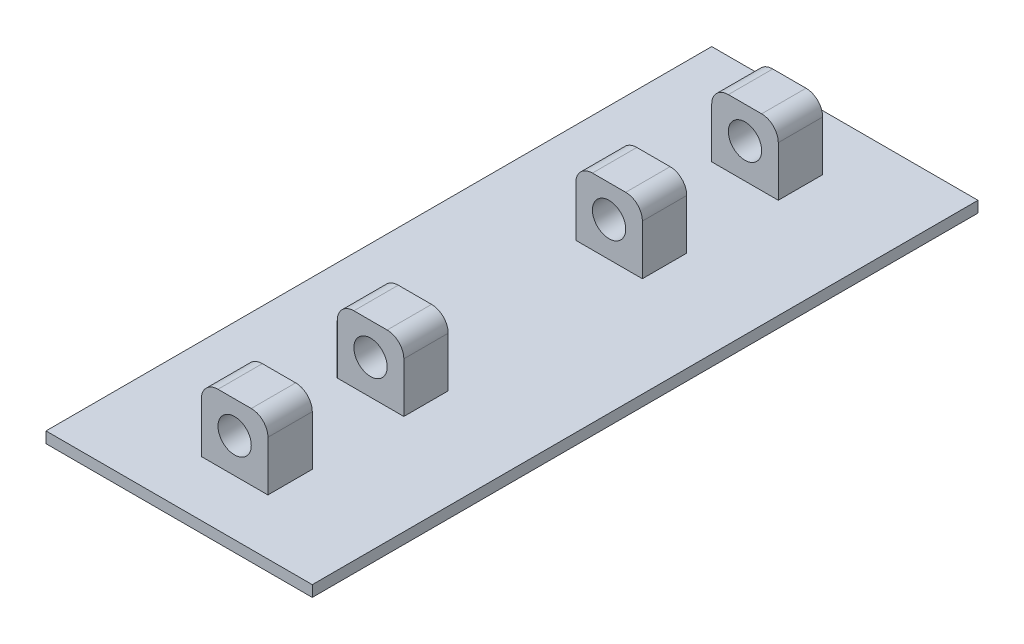
ISO-10303-21;
HEADER;
FILE_DESCRIPTION(('STEP AP214'),'2;1');
FILE_NAME('part.step','',(''),(''),'','','');
FILE_SCHEMA(('AUTOMOTIVE_DESIGN { 1 0 10303 214 1 1 1 1 }'));
ENDSEC;
DATA;
#1=APPLICATION_CONTEXT('core data for automotive mechanical design processes');
#2=APPLICATION_PROTOCOL_DEFINITION('international standard','automotive_design',2000,#1);
#3=PRODUCT_CONTEXT('',#1,'mechanical');
#4=PRODUCT('Part','Part','',(#3));
#5=PRODUCT_RELATED_PRODUCT_CATEGORY('part','',(#4));
#6=PRODUCT_DEFINITION_FORMATION('','',#4);
#7=PRODUCT_DEFINITION_CONTEXT('part definition',#1,'design');
#8=PRODUCT_DEFINITION('design','',#6,#7);
#9=PRODUCT_DEFINITION_SHAPE('','',#8);
#10=(LENGTH_UNIT() NAMED_UNIT(*) SI_UNIT(.MILLI.,.METRE.));
#11=(NAMED_UNIT(*) PLANE_ANGLE_UNIT() SI_UNIT($,.RADIAN.));
#12=(NAMED_UNIT(*) SI_UNIT($,.STERADIAN.) SOLID_ANGLE_UNIT());
#13=UNCERTAINTY_MEASURE_WITH_UNIT(LENGTH_MEASURE(1.E-05),#10,'distance_accuracy_value','');
#14=(GEOMETRIC_REPRESENTATION_CONTEXT(3) GLOBAL_UNCERTAINTY_ASSIGNED_CONTEXT((#13)) GLOBAL_UNIT_ASSIGNED_CONTEXT((#10,
#11,#12)) REPRESENTATION_CONTEXT('',''));
#15=CARTESIAN_POINT('',(0.,0.,0.));
#16=DIRECTION('',(0.,0.,1.));
#17=DIRECTION('',(1.,0.,0.));
#18=AXIS2_PLACEMENT_3D('',#15,#16,#17);
#19=CARTESIAN_POINT('',(-120.,10.,300.));
#20=DIRECTION('',(0.,1.,0.));
#21=DIRECTION('',(0.,0.,1.));
#22=AXIS2_PLACEMENT_3D('',#19,#20,#21);
#23=PLANE('',#22);
#24=DIRECTION('',(1.,0.,0.));
#25=VECTOR('',#24,1.);
#26=CARTESIAN_POINT('',(-30.,10.,-127.5));
#27=LINE('',#26,#25);
#28=CARTESIAN_POINT('',(-30.,10.,-127.5));
#29=VERTEX_POINT('',#28);
#30=CARTESIAN_POINT('',(30.,10.,-127.5));
#31=VERTEX_POINT('',#30);
#32=EDGE_CURVE('E224',#29,#31,#27,.T.);
#33=ORIENTED_EDGE('',*,*,#32,.T.);
#34=DIRECTION('',(0.,0.,1.));
#35=VECTOR('',#34,1.);
#36=CARTESIAN_POINT('',(30.,10.,-127.5));
#37=LINE('',#36,#35);
#38=CARTESIAN_POINT('',(30.,10.,-87.5));
#39=VERTEX_POINT('',#38);
#40=EDGE_CURVE('E246',#31,#39,#37,.T.);
#41=ORIENTED_EDGE('',*,*,#40,.T.);
#42=DIRECTION('',(1.,0.,0.));
#43=VECTOR('',#42,1.);
#44=CARTESIAN_POINT('',(-30.,10.,-87.5));
#45=LINE('',#44,#43);
#46=CARTESIAN_POINT('',(-30.,10.,-87.5));
#47=VERTEX_POINT('',#46);
#48=EDGE_CURVE('E245',#47,#39,#45,.T.);
#49=ORIENTED_EDGE('',*,*,#48,.F.);
#50=DIRECTION('',(0.,0.,1.));
#51=VECTOR('',#50,1.);
#52=CARTESIAN_POINT('',(-30.,10.,-127.5));
#53=LINE('',#52,#51);
#54=EDGE_CURVE('E239',#29,#47,#53,.T.);
#55=ORIENTED_EDGE('',*,*,#54,.F.);
#56=EDGE_LOOP('',(#33,#41,#49,#55));
#57=FACE_BOUND('',#56,.T.);
#58=DIRECTION('',(1.,0.,0.));
#59=VECTOR('',#58,1.);
#60=CARTESIAN_POINT('',(-30.,10.,127.5));
#61=LINE('',#60,#59);
#62=CARTESIAN_POINT('',(-30.,10.,127.5));
#63=VERTEX_POINT('',#62);
#64=CARTESIAN_POINT('',(30.,10.,127.5));
#65=VERTEX_POINT('',#64);
#66=EDGE_CURVE('E321',#63,#65,#61,.T.);
#67=ORIENTED_EDGE('',*,*,#66,.F.);
#68=DIRECTION('',(0.,0.,-1.));
#69=VECTOR('',#68,1.);
#70=CARTESIAN_POINT('',(-30.,10.,127.5));
#71=LINE('',#70,#69);
#72=CARTESIAN_POINT('',(-30.,10.,87.5));
#73=VERTEX_POINT('',#72);
#74=EDGE_CURVE('E337',#63,#73,#71,.T.);
#75=ORIENTED_EDGE('',*,*,#74,.T.);
#76=DIRECTION('',(1.,0.,0.));
#77=VECTOR('',#76,1.);
#78=CARTESIAN_POINT('',(-30.,10.,87.5));
#79=LINE('',#78,#77);
#80=CARTESIAN_POINT('',(30.,10.,87.5));
#81=VERTEX_POINT('',#80);
#82=EDGE_CURVE('E313',#73,#81,#79,.T.);
#83=ORIENTED_EDGE('',*,*,#82,.T.);
#84=DIRECTION('',(0.,0.,-1.));
#85=VECTOR('',#84,1.);
#86=CARTESIAN_POINT('',(30.,10.,127.5));
#87=LINE('',#86,#85);
#88=EDGE_CURVE('E341',#65,#81,#87,.T.);
#89=ORIENTED_EDGE('',*,*,#88,.F.);
#90=EDGE_LOOP('',(#67,#75,#83,#89));
#91=FACE_BOUND('',#90,.T.);
#92=DIRECTION('',(1.,0.,0.));
#93=VECTOR('',#92,1.);
#94=CARTESIAN_POINT('',(-30.,10.,210.));
#95=LINE('',#94,#93);
#96=CARTESIAN_POINT('',(-30.,10.,210.));
#97=VERTEX_POINT('',#96);
#98=CARTESIAN_POINT('',(30.,10.,210.));
#99=VERTEX_POINT('',#98);
#100=EDGE_CURVE('E363',#97,#99,#95,.T.);
#101=ORIENTED_EDGE('',*,*,#100,.T.);
#102=DIRECTION('',(0.,0.,1.));
#103=VECTOR('',#102,1.);
#104=CARTESIAN_POINT('',(30.,10.,210.));
#105=LINE('',#104,#103);
#106=CARTESIAN_POINT('',(30.,10.,250.));
#107=VERTEX_POINT('',#106);
#108=EDGE_CURVE('E404',#99,#107,#105,.T.);
#109=ORIENTED_EDGE('',*,*,#108,.T.);
#110=DIRECTION('',(1.,0.,0.));
#111=VECTOR('',#110,1.);
#112=CARTESIAN_POINT('',(-30.,10.,250.));
#113=LINE('',#112,#111);
#114=CARTESIAN_POINT('',(-30.,10.,250.));
#115=VERTEX_POINT('',#114);
#116=EDGE_CURVE('E381',#115,#107,#113,.T.);
#117=ORIENTED_EDGE('',*,*,#116,.F.);
#118=DIRECTION('',(0.,0.,1.));
#119=VECTOR('',#118,1.);
#120=CARTESIAN_POINT('',(-30.,10.,210.));
#121=LINE('',#120,#119);
#122=EDGE_CURVE('E379',#97,#115,#121,.T.);
#123=ORIENTED_EDGE('',*,*,#122,.F.);
#124=EDGE_LOOP('',(#101,#109,#117,#123));
#125=FACE_BOUND('',#124,.T.);
#126=DIRECTION('',(0.,0.,1.));
#127=VECTOR('',#126,1.);
#128=CARTESIAN_POINT('',(-120.,10.,-300.));
#129=LINE('',#128,#127);
#130=CARTESIAN_POINT('',(-120.,10.,-300.));
#131=VERTEX_POINT('',#130);
#132=CARTESIAN_POINT('',(-120.,10.,300.));
#133=VERTEX_POINT('',#132);
#134=EDGE_CURVE('E409',#131,#133,#129,.T.);
#135=ORIENTED_EDGE('',*,*,#134,.T.);
#136=DIRECTION('',(1.,0.,0.));
#137=VECTOR('',#136,1.);
#138=CARTESIAN_POINT('',(-120.,10.,300.));
#139=LINE('',#138,#137);
#140=CARTESIAN_POINT('',(120.,10.,300.));
#141=VERTEX_POINT('',#140);
#142=EDGE_CURVE('E412',#133,#141,#139,.T.);
#143=ORIENTED_EDGE('',*,*,#142,.T.);
#144=DIRECTION('',(0.,0.,-1.));
#145=VECTOR('',#144,1.);
#146=CARTESIAN_POINT('',(120.,10.,-300.));
#147=LINE('',#146,#145);
#148=CARTESIAN_POINT('',(120.,10.,-300.));
#149=VERTEX_POINT('',#148);
#150=EDGE_CURVE('E415',#141,#149,#147,.T.);
#151=ORIENTED_EDGE('',*,*,#150,.T.);
#152=DIRECTION('',(-1.,0.,0.));
#153=VECTOR('',#152,1.);
#154=CARTESIAN_POINT('',(-120.,10.,-300.));
#155=LINE('',#154,#153);
#156=EDGE_CURVE('E417',#149,#131,#155,.T.);
#157=ORIENTED_EDGE('',*,*,#156,.T.);
#158=EDGE_LOOP('',(#135,#143,#151,#157));
#159=FACE_BOUND('',#158,.T.);
#160=DIRECTION('',(1.,0.,0.));
#161=VECTOR('',#160,1.);
#162=CARTESIAN_POINT('',(-30.,10.,-210.));
#163=LINE('',#162,#161);
#164=CARTESIAN_POINT('',(-30.,10.,-210.));
#165=VERTEX_POINT('',#164);
#166=CARTESIAN_POINT('',(30.,10.,-210.));
#167=VERTEX_POINT('',#166);
#168=EDGE_CURVE('E272',#165,#167,#163,.T.);
#169=ORIENTED_EDGE('',*,*,#168,.F.);
#170=DIRECTION('',(0.,0.,-1.));
#171=VECTOR('',#170,1.);
#172=CARTESIAN_POINT('',(-30.,10.,-210.));
#173=LINE('',#172,#171);
#174=CARTESIAN_POINT('',(-30.,10.,-250.));
#175=VERTEX_POINT('',#174);
#176=EDGE_CURVE('E287',#165,#175,#173,.T.);
#177=ORIENTED_EDGE('',*,*,#176,.T.);
#178=DIRECTION('',(1.,0.,0.));
#179=VECTOR('',#178,1.);
#180=CARTESIAN_POINT('',(-30.,10.,-250.));
#181=LINE('',#180,#179);
#182=CARTESIAN_POINT('',(30.,10.,-250.));
#183=VERTEX_POINT('',#182);
#184=EDGE_CURVE('E265',#175,#183,#181,.T.);
#185=ORIENTED_EDGE('',*,*,#184,.T.);
#186=DIRECTION('',(0.,0.,-1.));
#187=VECTOR('',#186,1.);
#188=CARTESIAN_POINT('',(30.,10.,-210.));
#189=LINE('',#188,#187);
#190=EDGE_CURVE('E291',#167,#183,#189,.T.);
#191=ORIENTED_EDGE('',*,*,#190,.F.);
#192=EDGE_LOOP('',(#169,#177,#185,#191));
#193=FACE_BOUND('',#192,.T.);
#194=ADVANCED_FACE('F36',(#57,#91,#125,#159,#193),#23,.T.);
#195=CARTESIAN_POINT('',(-120.,10.,-300.));
#196=DIRECTION('',(1.,0.,0.));
#197=DIRECTION('',(0.,0.,-1.));
#198=AXIS2_PLACEMENT_3D('',#195,#196,#197);
#199=PLANE('',#198);
#200=DIRECTION('',(0.,0.,1.));
#201=VECTOR('',#200,1.);
#202=CARTESIAN_POINT('',(-120.,0.,-300.));
#203=LINE('',#202,#201);
#204=CARTESIAN_POINT('',(-120.,0.,-300.));
#205=VERTEX_POINT('',#204);
#206=CARTESIAN_POINT('',(-120.,0.,300.));
#207=VERTEX_POINT('',#206);
#208=EDGE_CURVE('E397',#205,#207,#203,.T.);
#209=ORIENTED_EDGE('',*,*,#208,.T.);
#210=DIRECTION('',(0.,-1.,0.));
#211=VECTOR('',#210,1.);
#212=CARTESIAN_POINT('',(-120.,10.,300.));
#213=LINE('',#212,#211);
#214=EDGE_CURVE('E11',#133,#207,#213,.T.);
#215=ORIENTED_EDGE('',*,*,#214,.F.);
#216=ORIENTED_EDGE('',*,*,#134,.F.);
#217=DIRECTION('',(0.,-1.,0.));
#218=VECTOR('',#217,1.);
#219=CARTESIAN_POINT('',(-120.,10.,-300.));
#220=LINE('',#219,#218);
#221=EDGE_CURVE('E419',#131,#205,#220,.T.);
#222=ORIENTED_EDGE('',*,*,#221,.T.);
#223=EDGE_LOOP('',(#209,#215,#216,#222));
#224=FACE_BOUND('',#223,.T.);
#225=ADVANCED_FACE('F38',(#224),#199,.F.);
#226=CARTESIAN_POINT('',(-120.,10.,300.));
#227=DIRECTION('',(0.,0.,-1.));
#228=DIRECTION('',(-1.,0.,0.));
#229=AXIS2_PLACEMENT_3D('',#226,#227,#228);
#230=PLANE('',#229);
#231=DIRECTION('',(1.,0.,0.));
#232=VECTOR('',#231,1.);
#233=CARTESIAN_POINT('',(-120.,0.,300.));
#234=LINE('',#233,#232);
#235=CARTESIAN_POINT('',(120.,0.,300.));
#236=VERTEX_POINT('',#235);
#237=EDGE_CURVE('E422',#207,#236,#234,.T.);
#238=ORIENTED_EDGE('',*,*,#237,.T.);
#239=DIRECTION('',(0.,-1.,0.));
#240=VECTOR('',#239,1.);
#241=CARTESIAN_POINT('',(120.,10.,300.));
#242=LINE('',#241,#240);
#243=EDGE_CURVE('E44',#141,#236,#242,.T.);
#244=ORIENTED_EDGE('',*,*,#243,.F.);
#245=ORIENTED_EDGE('',*,*,#142,.F.);
#246=ORIENTED_EDGE('',*,*,#214,.T.);
#247=EDGE_LOOP('',(#238,#244,#245,#246));
#248=FACE_BOUND('',#247,.T.);
#249=ADVANCED_FACE('F452',(#248),#230,.F.);
#250=CARTESIAN_POINT('',(120.,10.,-300.));
#251=DIRECTION('',(-1.,0.,0.));
#252=DIRECTION('',(0.,0.,1.));
#253=AXIS2_PLACEMENT_3D('',#250,#251,#252);
#254=PLANE('',#253);
#255=DIRECTION('',(0.,0.,-1.));
#256=VECTOR('',#255,1.);
#257=CARTESIAN_POINT('',(120.,0.,-300.));
#258=LINE('',#257,#256);
#259=CARTESIAN_POINT('',(120.,0.,-300.));
#260=VERTEX_POINT('',#259);
#261=EDGE_CURVE('E424',#236,#260,#258,.T.);
#262=ORIENTED_EDGE('',*,*,#261,.T.);
#263=DIRECTION('',(0.,-1.,0.));
#264=VECTOR('',#263,1.);
#265=CARTESIAN_POINT('',(120.,10.,-300.));
#266=LINE('',#265,#264);
#267=EDGE_CURVE('E429',#149,#260,#266,.T.);
#268=ORIENTED_EDGE('',*,*,#267,.F.);
#269=ORIENTED_EDGE('',*,*,#150,.F.);
#270=ORIENTED_EDGE('',*,*,#243,.T.);
#271=EDGE_LOOP('',(#262,#268,#269,#270));
#272=FACE_BOUND('',#271,.T.);
#273=ADVANCED_FACE('F436',(#272),#254,.F.);
#274=CARTESIAN_POINT('',(-120.,10.,-300.));
#275=DIRECTION('',(0.,0.,1.));
#276=DIRECTION('',(1.,0.,0.));
#277=AXIS2_PLACEMENT_3D('',#274,#275,#276);
#278=PLANE('',#277);
#279=DIRECTION('',(-1.,0.,0.));
#280=VECTOR('',#279,1.);
#281=CARTESIAN_POINT('',(-120.,0.,-300.));
#282=LINE('',#281,#280);
#283=EDGE_CURVE('E413',#260,#205,#282,.T.);
#284=ORIENTED_EDGE('',*,*,#283,.T.);
#285=ORIENTED_EDGE('',*,*,#221,.F.);
#286=ORIENTED_EDGE('',*,*,#156,.F.);
#287=ORIENTED_EDGE('',*,*,#267,.T.);
#288=EDGE_LOOP('',(#284,#285,#286,#287));
#289=FACE_BOUND('',#288,.T.);
#290=ADVANCED_FACE('F445',(#289),#278,.F.);
#291=CARTESIAN_POINT('',(-120.,0.,300.));
#292=DIRECTION('',(0.,1.,0.));
#293=DIRECTION('',(0.,0.,1.));
#294=AXIS2_PLACEMENT_3D('',#291,#292,#293);
#295=PLANE('',#294);
#296=ORIENTED_EDGE('',*,*,#208,.F.);
#297=ORIENTED_EDGE('',*,*,#283,.F.);
#298=ORIENTED_EDGE('',*,*,#261,.F.);
#299=ORIENTED_EDGE('',*,*,#237,.F.);
#300=EDGE_LOOP('',(#296,#297,#298,#299));
#301=FACE_BOUND('',#300,.T.);
#302=ADVANCED_FACE('F442',(#301),#295,.F.);
#303=CARTESIAN_POINT('',(-30.,10.,210.));
#304=DIRECTION('',(-1.,0.,0.));
#305=DIRECTION('',(0.,0.,1.));
#306=AXIS2_PLACEMENT_3D('',#303,#304,#305);
#307=PLANE('',#306);
#308=DIRECTION('',(0.,-1.,0.));
#309=VECTOR('',#308,1.);
#310=CARTESIAN_POINT('',(-30.,10.,250.));
#311=LINE('',#310,#309);
#312=CARTESIAN_POINT('',(-30.,55.,250.));
#313=VERTEX_POINT('',#312);
#314=EDGE_CURVE('E357',#313,#115,#311,.T.);
#315=ORIENTED_EDGE('',*,*,#314,.F.);
#316=DIRECTION('',(0.,0.,1.));
#317=VECTOR('',#316,1.);
#318=CARTESIAN_POINT('',(-30.,55.,210.));
#319=LINE('',#318,#317);
#320=CARTESIAN_POINT('',(-30.,55.,210.));
#321=VERTEX_POINT('',#320);
#322=EDGE_CURVE('E395',#321,#313,#319,.T.);
#323=ORIENTED_EDGE('',*,*,#322,.F.);
#324=DIRECTION('',(0.,-1.,0.));
#325=VECTOR('',#324,1.);
#326=CARTESIAN_POINT('',(-30.,10.,210.));
#327=LINE('',#326,#325);
#328=EDGE_CURVE('E360',#321,#97,#327,.T.);
#329=ORIENTED_EDGE('',*,*,#328,.T.);
#330=ORIENTED_EDGE('',*,*,#122,.T.);
#331=EDGE_LOOP('',(#315,#323,#329,#330));
#332=FACE_BOUND('',#331,.T.);
#333=ADVANCED_FACE('F465',(#332),#307,.T.);
#334=CARTESIAN_POINT('',(-15.,55.,210.));
#335=DIRECTION('',(0.,0.,1.));
#336=DIRECTION('',(1.,0.,0.));
#337=AXIS2_PLACEMENT_3D('',#334,#335,#336);
#338=CYLINDRICAL_SURFACE('',#337,15.);
#339=CARTESIAN_POINT('',(-15.,55.,250.));
#340=DIRECTION('',(0.,0.,1.));
#341=DIRECTION('',(-1.,0.,0.));
#342=AXIS2_PLACEMENT_3D('',#339,#340,#341);
#343=CIRCLE('',#342,15.);
#344=CARTESIAN_POINT('',(-15.,70.,250.));
#345=VERTEX_POINT('',#344);
#346=EDGE_CURVE('E364',#345,#313,#343,.T.);
#347=ORIENTED_EDGE('',*,*,#346,.F.);
#348=DIRECTION('',(0.,0.,1.));
#349=VECTOR('',#348,1.);
#350=CARTESIAN_POINT('',(-15.,70.,210.));
#351=LINE('',#350,#349);
#352=CARTESIAN_POINT('',(-15.,70.,210.));
#353=VERTEX_POINT('',#352);
#354=EDGE_CURVE('E398',#353,#345,#351,.T.);
#355=ORIENTED_EDGE('',*,*,#354,.F.);
#356=CARTESIAN_POINT('',(-15.,55.,210.));
#357=DIRECTION('',(0.,0.,1.));
#358=DIRECTION('',(-1.,0.,0.));
#359=AXIS2_PLACEMENT_3D('',#356,#357,#358);
#360=CIRCLE('',#359,15.);
#361=EDGE_CURVE('E376',#353,#321,#360,.T.);
#362=ORIENTED_EDGE('',*,*,#361,.T.);
#363=ORIENTED_EDGE('',*,*,#322,.T.);
#364=EDGE_LOOP('',(#347,#355,#362,#363));
#365=FACE_BOUND('',#364,.T.);
#366=ADVANCED_FACE('F484',(#365),#338,.T.);
#367=CARTESIAN_POINT('',(-15.,70.,210.));
#368=DIRECTION('',(0.,1.,0.));
#369=DIRECTION('',(0.,0.,1.));
#370=AXIS2_PLACEMENT_3D('',#367,#368,#369);
#371=PLANE('',#370);
#372=DIRECTION('',(-1.,0.,0.));
#373=VECTOR('',#372,1.);
#374=CARTESIAN_POINT('',(-15.,70.,250.));
#375=LINE('',#374,#373);
#376=CARTESIAN_POINT('',(15.,70.,250.));
#377=VERTEX_POINT('',#376);
#378=EDGE_CURVE('E390',#377,#345,#375,.T.);
#379=ORIENTED_EDGE('',*,*,#378,.F.);
#380=DIRECTION('',(0.,0.,1.));
#381=VECTOR('',#380,1.);
#382=CARTESIAN_POINT('',(15.,70.,210.));
#383=LINE('',#382,#381);
#384=CARTESIAN_POINT('',(15.,70.,210.));
#385=VERTEX_POINT('',#384);
#386=EDGE_CURVE('E400',#385,#377,#383,.T.);
#387=ORIENTED_EDGE('',*,*,#386,.F.);
#388=DIRECTION('',(-1.,0.,0.));
#389=VECTOR('',#388,1.);
#390=CARTESIAN_POINT('',(-15.,70.,210.));
#391=LINE('',#390,#389);
#392=EDGE_CURVE('E373',#385,#353,#391,.T.);
#393=ORIENTED_EDGE('',*,*,#392,.T.);
#394=ORIENTED_EDGE('',*,*,#354,.T.);
#395=EDGE_LOOP('',(#379,#387,#393,#394));
#396=FACE_BOUND('',#395,.T.);
#397=ADVANCED_FACE('F491',(#396),#371,.T.);
#398=CARTESIAN_POINT('',(15.,55.,210.));
#399=DIRECTION('',(0.,0.,1.));
#400=DIRECTION('',(1.,0.,0.));
#401=AXIS2_PLACEMENT_3D('',#398,#399,#400);
#402=CYLINDRICAL_SURFACE('',#401,15.);
#403=CARTESIAN_POINT('',(15.,55.,250.));
#404=DIRECTION('',(0.,0.,1.));
#405=DIRECTION('',(1.,0.,0.));
#406=AXIS2_PLACEMENT_3D('',#403,#404,#405);
#407=CIRCLE('',#406,15.);
#408=CARTESIAN_POINT('',(30.,55.,250.));
#409=VERTEX_POINT('',#408);
#410=EDGE_CURVE('E387',#409,#377,#407,.T.);
#411=ORIENTED_EDGE('',*,*,#410,.F.);
#412=DIRECTION('',(0.,0.,1.));
#413=VECTOR('',#412,1.);
#414=CARTESIAN_POINT('',(30.,55.,210.));
#415=LINE('',#414,#413);
#416=CARTESIAN_POINT('',(30.,55.,210.));
#417=VERTEX_POINT('',#416);
#418=EDGE_CURVE('E402',#417,#409,#415,.T.);
#419=ORIENTED_EDGE('',*,*,#418,.F.);
#420=CARTESIAN_POINT('',(15.,55.,210.));
#421=DIRECTION('',(0.,0.,1.));
#422=DIRECTION('',(1.,0.,0.));
#423=AXIS2_PLACEMENT_3D('',#420,#421,#422);
#424=CIRCLE('',#423,15.);
#425=EDGE_CURVE('E370',#417,#385,#424,.T.);
#426=ORIENTED_EDGE('',*,*,#425,.T.);
#427=ORIENTED_EDGE('',*,*,#386,.T.);
#428=EDGE_LOOP('',(#411,#419,#426,#427));
#429=FACE_BOUND('',#428,.T.);
#430=ADVANCED_FACE('F499',(#429),#402,.T.);
#431=CARTESIAN_POINT('',(30.,10.,210.));
#432=DIRECTION('',(1.,0.,0.));
#433=DIRECTION('',(0.,0.,-1.));
#434=AXIS2_PLACEMENT_3D('',#431,#432,#433);
#435=PLANE('',#434);
#436=DIRECTION('',(0.,1.,0.));
#437=VECTOR('',#436,1.);
#438=CARTESIAN_POINT('',(30.,10.,250.));
#439=LINE('',#438,#437);
#440=EDGE_CURVE('E384',#107,#409,#439,.T.);
#441=ORIENTED_EDGE('',*,*,#440,.F.);
#442=ORIENTED_EDGE('',*,*,#108,.F.);
#443=DIRECTION('',(0.,1.,0.));
#444=VECTOR('',#443,1.);
#445=CARTESIAN_POINT('',(30.,10.,210.));
#446=LINE('',#445,#444);
#447=EDGE_CURVE('E367',#99,#417,#446,.T.);
#448=ORIENTED_EDGE('',*,*,#447,.T.);
#449=ORIENTED_EDGE('',*,*,#418,.T.);
#450=EDGE_LOOP('',(#441,#442,#448,#449));
#451=FACE_BOUND('',#450,.T.);
#452=ADVANCED_FACE('F507',(#451),#435,.T.);
#453=CARTESIAN_POINT('',(-15.,55.,210.));
#454=DIRECTION('',(0.,0.,-1.));
#455=DIRECTION('',(-1.,0.,0.));
#456=AXIS2_PLACEMENT_3D('',#453,#454,#455);
#457=PLANE('',#456);
#458=CARTESIAN_POINT('',(0.,41.2142525033233,210.));
#459=DIRECTION('',(0.,0.,1.));
#460=DIRECTION('',(1.,0.,0.));
#461=AXIS2_PLACEMENT_3D('',#458,#459,#460);
#462=CIRCLE('',#461,15.);
#463=CARTESIAN_POINT('',(15.,41.2142525033233,210.));
#464=VERTEX_POINT('',#463);
#465=EDGE_CURVE('E354',#464,#464,#462,.T.);
#466=ORIENTED_EDGE('',*,*,#465,.T.);
#467=EDGE_LOOP('',(#466));
#468=FACE_BOUND('',#467,.T.);
#469=ORIENTED_EDGE('',*,*,#328,.F.);
#470=ORIENTED_EDGE('',*,*,#361,.F.);
#471=ORIENTED_EDGE('',*,*,#392,.F.);
#472=ORIENTED_EDGE('',*,*,#425,.F.);
#473=ORIENTED_EDGE('',*,*,#447,.F.);
#474=ORIENTED_EDGE('',*,*,#100,.F.);
#475=EDGE_LOOP('',(#469,#470,#471,#472,#473,#474));
#476=FACE_BOUND('',#475,.T.);
#477=ADVANCED_FACE('F515',(#468,#476),#457,.T.);
#478=CARTESIAN_POINT('',(-15.,55.,250.));
#479=DIRECTION('',(0.,0.,-1.));
#480=DIRECTION('',(-1.,0.,0.));
#481=AXIS2_PLACEMENT_3D('',#478,#479,#480);
#482=PLANE('',#481);
#483=CARTESIAN_POINT('',(0.,41.2142525033233,250.));
#484=DIRECTION('',(0.,0.,1.));
#485=DIRECTION('',(1.,0.,0.));
#486=AXIS2_PLACEMENT_3D('',#483,#484,#485);
#487=CIRCLE('',#486,15.);
#488=CARTESIAN_POINT('',(15.,41.2142525033233,250.));
#489=VERTEX_POINT('',#488);
#490=EDGE_CURVE('E340',#489,#489,#487,.T.);
#491=ORIENTED_EDGE('',*,*,#490,.F.);
#492=EDGE_LOOP('',(#491));
#493=FACE_BOUND('',#492,.T.);
#494=ORIENTED_EDGE('',*,*,#314,.T.);
#495=ORIENTED_EDGE('',*,*,#116,.T.);
#496=ORIENTED_EDGE('',*,*,#440,.T.);
#497=ORIENTED_EDGE('',*,*,#410,.T.);
#498=ORIENTED_EDGE('',*,*,#378,.T.);
#499=ORIENTED_EDGE('',*,*,#346,.T.);
#500=EDGE_LOOP('',(#494,#495,#496,#497,#498,#499));
#501=FACE_BOUND('',#500,.T.);
#502=ADVANCED_FACE('F522',(#493,#501),#482,.F.);
#503=CARTESIAN_POINT('',(0.,41.2142525033233,210.));
#504=DIRECTION('',(0.,0.,1.));
#505=DIRECTION('',(1.,0.,0.));
#506=AXIS2_PLACEMENT_3D('',#503,#504,#505);
#507=CYLINDRICAL_SURFACE('',#506,15.);
#508=ORIENTED_EDGE('',*,*,#465,.F.);
#509=EDGE_LOOP('',(#508));
#510=FACE_BOUND('',#509,.T.);
#511=ORIENTED_EDGE('',*,*,#490,.T.);
#512=EDGE_LOOP('',(#511));
#513=FACE_BOUND('',#512,.T.);
#514=ADVANCED_FACE('F530',(#510,#513),#507,.F.);
#515=CARTESIAN_POINT('',(-15.,55.,127.5));
#516=DIRECTION('',(0.,0.,1.));
#517=DIRECTION('',(-1.,0.,0.));
#518=AXIS2_PLACEMENT_3D('',#515,#516,#517);
#519=PLANE('',#518);
#520=DIRECTION('',(0.,-1.,0.));
#521=VECTOR('',#520,1.);
#522=CARTESIAN_POINT('',(-30.,10.,127.5));
#523=LINE('',#522,#521);
#524=CARTESIAN_POINT('',(-30.,55.,127.5));
#525=VERTEX_POINT('',#524);
#526=EDGE_CURVE('E310',#525,#63,#523,.T.);
#527=ORIENTED_EDGE('',*,*,#526,.T.);
#528=ORIENTED_EDGE('',*,*,#66,.T.);
#529=DIRECTION('',(0.,1.,0.));
#530=VECTOR('',#529,1.);
#531=CARTESIAN_POINT('',(30.,10.,127.5));
#532=LINE('',#531,#530);
#533=CARTESIAN_POINT('',(30.,55.,127.5));
#534=VERTEX_POINT('',#533);
#535=EDGE_CURVE('E319',#65,#534,#532,.T.);
#536=ORIENTED_EDGE('',*,*,#535,.T.);
#537=CARTESIAN_POINT('',(15.,55.,127.5));
#538=DIRECTION('',(0.,0.,1.));
#539=DIRECTION('',(1.,0.,0.));
#540=AXIS2_PLACEMENT_3D('',#537,#538,#539);
#541=CIRCLE('',#540,15.);
#542=CARTESIAN_POINT('',(15.,70.,127.5));
#543=VERTEX_POINT('',#542);
#544=EDGE_CURVE('E317',#534,#543,#541,.T.);
#545=ORIENTED_EDGE('',*,*,#544,.T.);
#546=DIRECTION('',(-1.,0.,0.));
#547=VECTOR('',#546,1.);
#548=CARTESIAN_POINT('',(-15.,70.,127.5));
#549=LINE('',#548,#547);
#550=CARTESIAN_POINT('',(-15.,70.,127.5));
#551=VERTEX_POINT('',#550);
#552=EDGE_CURVE('E315',#543,#551,#549,.T.);
#553=ORIENTED_EDGE('',*,*,#552,.T.);
#554=CARTESIAN_POINT('',(-15.,55.,127.5));
#555=DIRECTION('',(0.,0.,1.));
#556=DIRECTION('',(-1.,0.,0.));
#557=AXIS2_PLACEMENT_3D('',#554,#555,#556);
#558=CIRCLE('',#557,15.);
#559=EDGE_CURVE('E312',#551,#525,#558,.T.);
#560=ORIENTED_EDGE('',*,*,#559,.T.);
#561=EDGE_LOOP('',(#527,#528,#536,#545,#553,#560));
#562=FACE_BOUND('',#561,.T.);
#563=CARTESIAN_POINT('',(0.,41.2142525033233,127.5));
#564=DIRECTION('',(0.,0.,1.));
#565=DIRECTION('',(1.,0.,0.));
#566=AXIS2_PLACEMENT_3D('',#563,#564,#565);
#567=CIRCLE('',#566,15.);
#568=CARTESIAN_POINT('',(15.,41.2142525033233,127.5));
#569=VERTEX_POINT('',#568);
#570=EDGE_CURVE('E304',#569,#569,#567,.T.);
#571=ORIENTED_EDGE('',*,*,#570,.F.);
#572=EDGE_LOOP('',(#571));
#573=FACE_BOUND('',#572,.T.);
#574=ADVANCED_FACE('F538',(#562,#573),#519,.T.);
#575=CARTESIAN_POINT('',(-15.,55.,87.5));
#576=DIRECTION('',(0.,0.,1.));
#577=DIRECTION('',(-1.,0.,0.));
#578=AXIS2_PLACEMENT_3D('',#575,#576,#577);
#579=PLANE('',#578);
#580=DIRECTION('',(0.,-1.,0.));
#581=VECTOR('',#580,1.);
#582=CARTESIAN_POINT('',(-30.,10.,87.5));
#583=LINE('',#582,#581);
#584=CARTESIAN_POINT('',(-30.,55.,87.5));
#585=VERTEX_POINT('',#584);
#586=EDGE_CURVE('E307',#585,#73,#583,.T.);
#587=ORIENTED_EDGE('',*,*,#586,.F.);
#588=CARTESIAN_POINT('',(-15.,55.,87.5));
#589=DIRECTION('',(0.,0.,1.));
#590=DIRECTION('',(-1.,0.,0.));
#591=AXIS2_PLACEMENT_3D('',#588,#589,#590);
#592=CIRCLE('',#591,15.);
#593=CARTESIAN_POINT('',(-15.,70.,87.5));
#594=VERTEX_POINT('',#593);
#595=EDGE_CURVE('E327',#594,#585,#592,.T.);
#596=ORIENTED_EDGE('',*,*,#595,.F.);
#597=DIRECTION('',(-1.,0.,0.));
#598=VECTOR('',#597,1.);
#599=CARTESIAN_POINT('',(-15.,70.,87.5));
#600=LINE('',#599,#598);
#601=CARTESIAN_POINT('',(15.,70.,87.5));
#602=VERTEX_POINT('',#601);
#603=EDGE_CURVE('E329',#602,#594,#600,.T.);
#604=ORIENTED_EDGE('',*,*,#603,.F.);
#605=CARTESIAN_POINT('',(15.,55.,87.5));
#606=DIRECTION('',(0.,0.,1.));
#607=DIRECTION('',(1.,0.,0.));
#608=AXIS2_PLACEMENT_3D('',#605,#606,#607);
#609=CIRCLE('',#608,15.);
#610=CARTESIAN_POINT('',(30.,55.,87.5));
#611=VERTEX_POINT('',#610);
#612=EDGE_CURVE('E331',#611,#602,#609,.T.);
#613=ORIENTED_EDGE('',*,*,#612,.F.);
#614=DIRECTION('',(0.,1.,0.));
#615=VECTOR('',#614,1.);
#616=CARTESIAN_POINT('',(30.,10.,87.5));
#617=LINE('',#616,#615);
#618=EDGE_CURVE('E333',#81,#611,#617,.T.);
#619=ORIENTED_EDGE('',*,*,#618,.F.);
#620=ORIENTED_EDGE('',*,*,#82,.F.);
#621=EDGE_LOOP('',(#587,#596,#604,#613,#619,#620));
#622=FACE_BOUND('',#621,.T.);
#623=CARTESIAN_POINT('',(0.,41.2142525033233,87.5));
#624=DIRECTION('',(0.,0.,1.));
#625=DIRECTION('',(1.,0.,0.));
#626=AXIS2_PLACEMENT_3D('',#623,#624,#625);
#627=CIRCLE('',#626,15.);
#628=CARTESIAN_POINT('',(15.,41.2142525033233,87.5));
#629=VERTEX_POINT('',#628);
#630=EDGE_CURVE('E290',#629,#629,#627,.T.);
#631=ORIENTED_EDGE('',*,*,#630,.T.);
#632=EDGE_LOOP('',(#631));
#633=FACE_BOUND('',#632,.T.);
#634=ADVANCED_FACE('F546',(#622,#633),#579,.F.);
#635=CARTESIAN_POINT('',(-30.,10.,127.5));
#636=DIRECTION('',(1.,0.,0.));
#637=DIRECTION('',(0.,0.,-1.));
#638=AXIS2_PLACEMENT_3D('',#635,#636,#637);
#639=PLANE('',#638);
#640=ORIENTED_EDGE('',*,*,#586,.T.);
#641=ORIENTED_EDGE('',*,*,#74,.F.);
#642=ORIENTED_EDGE('',*,*,#526,.F.);
#643=DIRECTION('',(0.,0.,-1.));
#644=VECTOR('',#643,1.);
#645=CARTESIAN_POINT('',(-30.,55.,127.5));
#646=LINE('',#645,#644);
#647=EDGE_CURVE('E324',#525,#585,#646,.T.);
#648=ORIENTED_EDGE('',*,*,#647,.T.);
#649=EDGE_LOOP('',(#640,#641,#642,#648));
#650=FACE_BOUND('',#649,.T.);
#651=ADVANCED_FACE('F554',(#650),#639,.F.);
#652=CARTESIAN_POINT('',(30.,10.,127.5));
#653=DIRECTION('',(-1.,0.,0.));
#654=DIRECTION('',(0.,0.,1.));
#655=AXIS2_PLACEMENT_3D('',#652,#653,#654);
#656=PLANE('',#655);
#657=ORIENTED_EDGE('',*,*,#618,.T.);
#658=DIRECTION('',(0.,0.,-1.));
#659=VECTOR('',#658,1.);
#660=CARTESIAN_POINT('',(30.,55.,127.5));
#661=LINE('',#660,#659);
#662=EDGE_CURVE('E343',#534,#611,#661,.T.);
#663=ORIENTED_EDGE('',*,*,#662,.F.);
#664=ORIENTED_EDGE('',*,*,#535,.F.);
#665=ORIENTED_EDGE('',*,*,#88,.T.);
#666=EDGE_LOOP('',(#657,#663,#664,#665));
#667=FACE_BOUND('',#666,.T.);
#668=ADVANCED_FACE('F562',(#667),#656,.F.);
#669=CARTESIAN_POINT('',(15.,55.,127.5));
#670=DIRECTION('',(0.,0.,-1.));
#671=DIRECTION('',(-1.,0.,0.));
#672=AXIS2_PLACEMENT_3D('',#669,#670,#671);
#673=CYLINDRICAL_SURFACE('',#672,15.);
#674=ORIENTED_EDGE('',*,*,#612,.T.);
#675=DIRECTION('',(0.,0.,-1.));
#676=VECTOR('',#675,1.);
#677=CARTESIAN_POINT('',(15.,70.,127.5));
#678=LINE('',#677,#676);
#679=EDGE_CURVE('E346',#543,#602,#678,.T.);
#680=ORIENTED_EDGE('',*,*,#679,.F.);
#681=ORIENTED_EDGE('',*,*,#544,.F.);
#682=ORIENTED_EDGE('',*,*,#662,.T.);
#683=EDGE_LOOP('',(#674,#680,#681,#682));
#684=FACE_BOUND('',#683,.T.);
#685=ADVANCED_FACE('F570',(#684),#673,.T.);
#686=CARTESIAN_POINT('',(-15.,70.,127.5));
#687=DIRECTION('',(0.,-1.,0.));
#688=DIRECTION('',(0.,0.,-1.));
#689=AXIS2_PLACEMENT_3D('',#686,#687,#688);
#690=PLANE('',#689);
#691=ORIENTED_EDGE('',*,*,#603,.T.);
#692=DIRECTION('',(0.,0.,-1.));
#693=VECTOR('',#692,1.);
#694=CARTESIAN_POINT('',(-15.,70.,127.5));
#695=LINE('',#694,#693);
#696=EDGE_CURVE('E349',#551,#594,#695,.T.);
#697=ORIENTED_EDGE('',*,*,#696,.F.);
#698=ORIENTED_EDGE('',*,*,#552,.F.);
#699=ORIENTED_EDGE('',*,*,#679,.T.);
#700=EDGE_LOOP('',(#691,#697,#698,#699));
#701=FACE_BOUND('',#700,.T.);
#702=ADVANCED_FACE('F578',(#701),#690,.F.);
#703=CARTESIAN_POINT('',(-15.,55.,127.5));
#704=DIRECTION('',(0.,0.,-1.));
#705=DIRECTION('',(-1.,0.,0.));
#706=AXIS2_PLACEMENT_3D('',#703,#704,#705);
#707=CYLINDRICAL_SURFACE('',#706,15.);
#708=ORIENTED_EDGE('',*,*,#595,.T.);
#709=ORIENTED_EDGE('',*,*,#647,.F.);
#710=ORIENTED_EDGE('',*,*,#559,.F.);
#711=ORIENTED_EDGE('',*,*,#696,.T.);
#712=EDGE_LOOP('',(#708,#709,#710,#711));
#713=FACE_BOUND('',#712,.T.);
#714=ADVANCED_FACE('F586',(#713),#707,.T.);
#715=CARTESIAN_POINT('',(0.,41.2142525033233,127.5));
#716=DIRECTION('',(0.,0.,-1.));
#717=DIRECTION('',(-1.,0.,0.));
#718=AXIS2_PLACEMENT_3D('',#715,#716,#717);
#719=CYLINDRICAL_SURFACE('',#718,15.);
#720=ORIENTED_EDGE('',*,*,#570,.T.);
#721=EDGE_LOOP('',(#720));
#722=FACE_BOUND('',#721,.T.);
#723=ORIENTED_EDGE('',*,*,#630,.F.);
#724=EDGE_LOOP('',(#723));
#725=FACE_BOUND('',#724,.T.);
#726=ADVANCED_FACE('F594',(#722,#725),#719,.F.);
#727=CARTESIAN_POINT('',(-15.,55.,-210.));
#728=DIRECTION('',(0.,0.,1.));
#729=DIRECTION('',(-1.,0.,0.));
#730=AXIS2_PLACEMENT_3D('',#727,#728,#729);
#731=PLANE('',#730);
#732=DIRECTION('',(0.,-1.,0.));
#733=VECTOR('',#732,1.);
#734=CARTESIAN_POINT('',(-30.,10.,-210.));
#735=LINE('',#734,#733);
#736=CARTESIAN_POINT('',(-30.,55.,-210.));
#737=VERTEX_POINT('',#736);
#738=EDGE_CURVE('E262',#737,#165,#735,.T.);
#739=ORIENTED_EDGE('',*,*,#738,.T.);
#740=ORIENTED_EDGE('',*,*,#168,.T.);
#741=DIRECTION('',(0.,1.,0.));
#742=VECTOR('',#741,1.);
#743=CARTESIAN_POINT('',(30.,10.,-210.));
#744=LINE('',#743,#742);
#745=CARTESIAN_POINT('',(30.,55.,-210.));
#746=VERTEX_POINT('',#745);
#747=EDGE_CURVE('E59',#167,#746,#744,.T.);
#748=ORIENTED_EDGE('',*,*,#747,.T.);
#749=CARTESIAN_POINT('',(15.,55.,-210.));
#750=DIRECTION('',(0.,0.,1.));
#751=DIRECTION('',(1.,0.,0.));
#752=AXIS2_PLACEMENT_3D('',#749,#750,#751);
#753=CIRCLE('',#752,15.);
#754=CARTESIAN_POINT('',(15.,70.,-210.));
#755=VERTEX_POINT('',#754);
#756=EDGE_CURVE('E269',#746,#755,#753,.T.);
#757=ORIENTED_EDGE('',*,*,#756,.T.);
#758=DIRECTION('',(-1.,0.,0.));
#759=VECTOR('',#758,1.);
#760=CARTESIAN_POINT('',(-15.,70.,-210.));
#761=LINE('',#760,#759);
#762=CARTESIAN_POINT('',(-15.,70.,-210.));
#763=VERTEX_POINT('',#762);
#764=EDGE_CURVE('E267',#755,#763,#761,.T.);
#765=ORIENTED_EDGE('',*,*,#764,.T.);
#766=CARTESIAN_POINT('',(-15.,55.,-210.));
#767=DIRECTION('',(0.,0.,1.));
#768=DIRECTION('',(-1.,0.,0.));
#769=AXIS2_PLACEMENT_3D('',#766,#767,#768);
#770=CIRCLE('',#769,15.);
#771=EDGE_CURVE('E264',#763,#737,#770,.T.);
#772=ORIENTED_EDGE('',*,*,#771,.T.);
#773=EDGE_LOOP('',(#739,#740,#748,#757,#765,#772));
#774=FACE_BOUND('',#773,.T.);
#775=CARTESIAN_POINT('',(0.,41.2142525033233,-210.));
#776=DIRECTION('',(0.,0.,1.));
#777=DIRECTION('',(1.,0.,0.));
#778=AXIS2_PLACEMENT_3D('',#775,#776,#777);
#779=CIRCLE('',#778,15.);
#780=CARTESIAN_POINT('',(15.,41.2142525033233,-210.));
#781=VERTEX_POINT('',#780);
#782=EDGE_CURVE('E255',#781,#781,#779,.T.);
#783=ORIENTED_EDGE('',*,*,#782,.F.);
#784=EDGE_LOOP('',(#783));
#785=FACE_BOUND('',#784,.T.);
#786=ADVANCED_FACE('F602',(#774,#785),#731,.T.);
#787=CARTESIAN_POINT('',(-15.,55.,-250.));
#788=DIRECTION('',(0.,0.,1.));
#789=DIRECTION('',(-1.,0.,0.));
#790=AXIS2_PLACEMENT_3D('',#787,#788,#789);
#791=PLANE('',#790);
#792=DIRECTION('',(0.,-1.,0.));
#793=VECTOR('',#792,1.);
#794=CARTESIAN_POINT('',(-30.,10.,-250.));
#795=LINE('',#794,#793);
#796=CARTESIAN_POINT('',(-30.,55.,-250.));
#797=VERTEX_POINT('',#796);
#798=EDGE_CURVE('E258',#797,#175,#795,.T.);
#799=ORIENTED_EDGE('',*,*,#798,.F.);
#800=CARTESIAN_POINT('',(-15.,55.,-250.));
#801=DIRECTION('',(0.,0.,1.));
#802=DIRECTION('',(-1.,0.,0.));
#803=AXIS2_PLACEMENT_3D('',#800,#801,#802);
#804=CIRCLE('',#803,15.);
#805=CARTESIAN_POINT('',(-15.,70.,-250.));
#806=VERTEX_POINT('',#805);
#807=EDGE_CURVE('E277',#806,#797,#804,.T.);
#808=ORIENTED_EDGE('',*,*,#807,.F.);
#809=DIRECTION('',(-1.,0.,0.));
#810=VECTOR('',#809,1.);
#811=CARTESIAN_POINT('',(-15.,70.,-250.));
#812=LINE('',#811,#810);
#813=CARTESIAN_POINT('',(15.,70.,-250.));
#814=VERTEX_POINT('',#813);
#815=EDGE_CURVE('E279',#814,#806,#812,.T.);
#816=ORIENTED_EDGE('',*,*,#815,.F.);
#817=CARTESIAN_POINT('',(15.,55.,-250.));
#818=DIRECTION('',(0.,0.,1.));
#819=DIRECTION('',(1.,0.,0.));
#820=AXIS2_PLACEMENT_3D('',#817,#818,#819);
#821=CIRCLE('',#820,15.);
#822=CARTESIAN_POINT('',(30.,55.,-250.));
#823=VERTEX_POINT('',#822);
#824=EDGE_CURVE('E281',#823,#814,#821,.T.);
#825=ORIENTED_EDGE('',*,*,#824,.F.);
#826=DIRECTION('',(0.,1.,0.));
#827=VECTOR('',#826,1.);
#828=CARTESIAN_POINT('',(30.,10.,-250.));
#829=LINE('',#828,#827);
#830=EDGE_CURVE('E283',#183,#823,#829,.T.);
#831=ORIENTED_EDGE('',*,*,#830,.F.);
#832=ORIENTED_EDGE('',*,*,#184,.F.);
#833=EDGE_LOOP('',(#799,#808,#816,#825,#831,#832));
#834=FACE_BOUND('',#833,.T.);
#835=CARTESIAN_POINT('',(0.,41.2142525033233,-250.));
#836=DIRECTION('',(0.,0.,1.));
#837=DIRECTION('',(1.,0.,0.));
#838=AXIS2_PLACEMENT_3D('',#835,#836,#837);
#839=CIRCLE('',#838,15.);
#840=CARTESIAN_POINT('',(15.,41.2142525033233,-250.));
#841=VERTEX_POINT('',#840);
#842=EDGE_CURVE('E259',#841,#841,#839,.T.);
#843=ORIENTED_EDGE('',*,*,#842,.T.);
#844=EDGE_LOOP('',(#843));
#845=FACE_BOUND('',#844,.T.);
#846=ADVANCED_FACE('F610',(#834,#845),#791,.F.);
#847=CARTESIAN_POINT('',(-30.,10.,-210.));
#848=DIRECTION('',(1.,0.,0.));
#849=DIRECTION('',(0.,0.,-1.));
#850=AXIS2_PLACEMENT_3D('',#847,#848,#849);
#851=PLANE('',#850);
#852=ORIENTED_EDGE('',*,*,#798,.T.);
#853=ORIENTED_EDGE('',*,*,#176,.F.);
#854=ORIENTED_EDGE('',*,*,#738,.F.);
#855=DIRECTION('',(0.,0.,-1.));
#856=VECTOR('',#855,1.);
#857=CARTESIAN_POINT('',(-30.,55.,-210.));
#858=LINE('',#857,#856);
#859=EDGE_CURVE('E274',#737,#797,#858,.T.);
#860=ORIENTED_EDGE('',*,*,#859,.T.);
#861=EDGE_LOOP('',(#852,#853,#854,#860));
#862=FACE_BOUND('',#861,.T.);
#863=ADVANCED_FACE('F618',(#862),#851,.F.);
#864=CARTESIAN_POINT('',(30.,10.,-210.));
#865=DIRECTION('',(-1.,0.,0.));
#866=DIRECTION('',(0.,0.,1.));
#867=AXIS2_PLACEMENT_3D('',#864,#865,#866);
#868=PLANE('',#867);
#869=ORIENTED_EDGE('',*,*,#830,.T.);
#870=DIRECTION('',(0.,0.,-1.));
#871=VECTOR('',#870,1.);
#872=CARTESIAN_POINT('',(30.,55.,-210.));
#873=LINE('',#872,#871);
#874=EDGE_CURVE('E293',#746,#823,#873,.T.);
#875=ORIENTED_EDGE('',*,*,#874,.F.);
#876=ORIENTED_EDGE('',*,*,#747,.F.);
#877=ORIENTED_EDGE('',*,*,#190,.T.);
#878=EDGE_LOOP('',(#869,#875,#876,#877));
#879=FACE_BOUND('',#878,.T.);
#880=ADVANCED_FACE('F626',(#879),#868,.F.);
#881=CARTESIAN_POINT('',(15.,55.,-210.));
#882=DIRECTION('',(0.,0.,-1.));
#883=DIRECTION('',(-1.,0.,0.));
#884=AXIS2_PLACEMENT_3D('',#881,#882,#883);
#885=CYLINDRICAL_SURFACE('',#884,15.);
#886=ORIENTED_EDGE('',*,*,#824,.T.);
#887=DIRECTION('',(0.,0.,-1.));
#888=VECTOR('',#887,1.);
#889=CARTESIAN_POINT('',(15.,70.,-210.));
#890=LINE('',#889,#888);
#891=EDGE_CURVE('E296',#755,#814,#890,.T.);
#892=ORIENTED_EDGE('',*,*,#891,.F.);
#893=ORIENTED_EDGE('',*,*,#756,.F.);
#894=ORIENTED_EDGE('',*,*,#874,.T.);
#895=EDGE_LOOP('',(#886,#892,#893,#894));
#896=FACE_BOUND('',#895,.T.);
#897=ADVANCED_FACE('F634',(#896),#885,.T.);
#898=CARTESIAN_POINT('',(-15.,70.,-210.));
#899=DIRECTION('',(0.,-1.,0.));
#900=DIRECTION('',(0.,0.,-1.));
#901=AXIS2_PLACEMENT_3D('',#898,#899,#900);
#902=PLANE('',#901);
#903=ORIENTED_EDGE('',*,*,#815,.T.);
#904=DIRECTION('',(0.,0.,-1.));
#905=VECTOR('',#904,1.);
#906=CARTESIAN_POINT('',(-15.,70.,-210.));
#907=LINE('',#906,#905);
#908=EDGE_CURVE('E299',#763,#806,#907,.T.);
#909=ORIENTED_EDGE('',*,*,#908,.F.);
#910=ORIENTED_EDGE('',*,*,#764,.F.);
#911=ORIENTED_EDGE('',*,*,#891,.T.);
#912=EDGE_LOOP('',(#903,#909,#910,#911));
#913=FACE_BOUND('',#912,.T.);
#914=ADVANCED_FACE('F641',(#913),#902,.F.);
#915=CARTESIAN_POINT('',(-15.,55.,-210.));
#916=DIRECTION('',(0.,0.,-1.));
#917=DIRECTION('',(-1.,0.,0.));
#918=AXIS2_PLACEMENT_3D('',#915,#916,#917);
#919=CYLINDRICAL_SURFACE('',#918,15.);
#920=ORIENTED_EDGE('',*,*,#807,.T.);
#921=ORIENTED_EDGE('',*,*,#859,.F.);
#922=ORIENTED_EDGE('',*,*,#771,.F.);
#923=ORIENTED_EDGE('',*,*,#908,.T.);
#924=EDGE_LOOP('',(#920,#921,#922,#923));
#925=FACE_BOUND('',#924,.T.);
#926=ADVANCED_FACE('F649',(#925),#919,.T.);
#927=CARTESIAN_POINT('',(0.,41.2142525033233,-210.));
#928=DIRECTION('',(0.,0.,-1.));
#929=DIRECTION('',(-1.,0.,0.));
#930=AXIS2_PLACEMENT_3D('',#927,#928,#929);
#931=CYLINDRICAL_SURFACE('',#930,15.);
#932=ORIENTED_EDGE('',*,*,#782,.T.);
#933=EDGE_LOOP('',(#932));
#934=FACE_BOUND('',#933,.T.);
#935=ORIENTED_EDGE('',*,*,#842,.F.);
#936=EDGE_LOOP('',(#935));
#937=FACE_BOUND('',#936,.T.);
#938=ADVANCED_FACE('F657',(#934,#937),#931,.F.);
#939=CARTESIAN_POINT('',(-30.,10.,-127.5));
#940=DIRECTION('',(-1.,0.,0.));
#941=DIRECTION('',(0.,0.,1.));
#942=AXIS2_PLACEMENT_3D('',#939,#940,#941);
#943=PLANE('',#942);
#944=DIRECTION('',(0.,-1.,0.));
#945=VECTOR('',#944,1.);
#946=CARTESIAN_POINT('',(-30.,10.,-87.5));
#947=LINE('',#946,#945);
#948=CARTESIAN_POINT('',(-30.,55.,-87.5));
#949=VERTEX_POINT('',#948);
#950=EDGE_CURVE('E51',#949,#47,#947,.T.);
#951=ORIENTED_EDGE('',*,*,#950,.F.);
#952=DIRECTION('',(0.,0.,1.));
#953=VECTOR('',#952,1.);
#954=CARTESIAN_POINT('',(-30.,55.,-127.5));
#955=LINE('',#954,#953);
#956=CARTESIAN_POINT('',(-30.,55.,-127.5));
#957=VERTEX_POINT('',#956);
#958=EDGE_CURVE('E241',#957,#949,#955,.T.);
#959=ORIENTED_EDGE('',*,*,#958,.F.);
#960=DIRECTION('',(0.,-1.,0.));
#961=VECTOR('',#960,1.);
#962=CARTESIAN_POINT('',(-30.,10.,-127.5));
#963=LINE('',#962,#961);
#964=EDGE_CURVE('E228',#957,#29,#963,.T.);
#965=ORIENTED_EDGE('',*,*,#964,.T.);
#966=ORIENTED_EDGE('',*,*,#54,.T.);
#967=EDGE_LOOP('',(#951,#959,#965,#966));
#968=FACE_BOUND('',#967,.T.);
#969=ADVANCED_FACE('F238',(#968),#943,.T.);
#970=CARTESIAN_POINT('',(-15.,55.,-127.5));
#971=DIRECTION('',(0.,0.,1.));
#972=DIRECTION('',(1.,0.,0.));
#973=AXIS2_PLACEMENT_3D('',#970,#971,#972);
#974=CYLINDRICAL_SURFACE('',#973,15.);
#975=CARTESIAN_POINT('',(-15.,55.,-87.5));
#976=DIRECTION('',(0.,0.,1.));
#977=DIRECTION('',(-1.,0.,0.));
#978=AXIS2_PLACEMENT_3D('',#975,#976,#977);
#979=CIRCLE('',#978,15.);
#980=CARTESIAN_POINT('',(-15.,70.,-87.5));
#981=VERTEX_POINT('',#980);
#982=EDGE_CURVE('E242',#981,#949,#979,.T.);
#983=ORIENTED_EDGE('',*,*,#982,.F.);
#984=DIRECTION('',(0.,0.,1.));
#985=VECTOR('',#984,1.);
#986=CARTESIAN_POINT('',(-15.,70.,-127.5));
#987=LINE('',#986,#985);
#988=CARTESIAN_POINT('',(-15.,70.,-127.5));
#989=VERTEX_POINT('',#988);
#990=EDGE_CURVE('E844',#989,#981,#987,.T.);
#991=ORIENTED_EDGE('',*,*,#990,.F.);
#992=CARTESIAN_POINT('',(-15.,55.,-127.5));
#993=DIRECTION('',(0.,0.,1.));
#994=DIRECTION('',(-1.,0.,0.));
#995=AXIS2_PLACEMENT_3D('',#992,#993,#994);
#996=CIRCLE('',#995,15.);
#997=EDGE_CURVE('E247',#989,#957,#996,.T.);
#998=ORIENTED_EDGE('',*,*,#997,.T.);
#999=ORIENTED_EDGE('',*,*,#958,.T.);
#1000=EDGE_LOOP('',(#983,#991,#998,#999));
#1001=FACE_BOUND('',#1000,.T.);
#1002=ADVANCED_FACE('F672',(#1001),#974,.T.);
#1003=CARTESIAN_POINT('',(-15.,70.,-127.5));
#1004=DIRECTION('',(0.,1.,0.));
#1005=DIRECTION('',(0.,0.,1.));
#1006=AXIS2_PLACEMENT_3D('',#1003,#1004,#1005);
#1007=PLANE('',#1006);
#1008=DIRECTION('',(-1.,0.,0.));
#1009=VECTOR('',#1008,1.);
#1010=CARTESIAN_POINT('',(-15.,70.,-87.5));
#1011=LINE('',#1010,#1009);
#1012=CARTESIAN_POINT('',(15.,70.,-87.5));
#1013=VERTEX_POINT('',#1012);
#1014=EDGE_CURVE('E839',#1013,#981,#1011,.T.);
#1015=ORIENTED_EDGE('',*,*,#1014,.F.);
#1016=DIRECTION('',(0.,0.,1.));
#1017=VECTOR('',#1016,1.);
#1018=CARTESIAN_POINT('',(15.,70.,-127.5));
#1019=LINE('',#1018,#1017);
#1020=CARTESIAN_POINT('',(15.,70.,-127.5));
#1021=VERTEX_POINT('',#1020);
#1022=EDGE_CURVE('E846',#1021,#1013,#1019,.T.);
#1023=ORIENTED_EDGE('',*,*,#1022,.F.);
#1024=DIRECTION('',(-1.,0.,0.));
#1025=VECTOR('',#1024,1.);
#1026=CARTESIAN_POINT('',(-15.,70.,-127.5));
#1027=LINE('',#1026,#1025);
#1028=EDGE_CURVE('E251',#1021,#989,#1027,.T.);
#1029=ORIENTED_EDGE('',*,*,#1028,.T.);
#1030=ORIENTED_EDGE('',*,*,#990,.T.);
#1031=EDGE_LOOP('',(#1015,#1023,#1029,#1030));
#1032=FACE_BOUND('',#1031,.T.);
#1033=ADVANCED_FACE('F679',(#1032),#1007,.T.);
#1034=CARTESIAN_POINT('',(15.,55.,-127.5));
#1035=DIRECTION('',(0.,0.,1.));
#1036=DIRECTION('',(1.,0.,0.));
#1037=AXIS2_PLACEMENT_3D('',#1034,#1035,#1036);
#1038=CYLINDRICAL_SURFACE('',#1037,15.);
#1039=CARTESIAN_POINT('',(15.,55.,-87.5));
#1040=DIRECTION('',(0.,0.,1.));
#1041=DIRECTION('',(1.,0.,0.));
#1042=AXIS2_PLACEMENT_3D('',#1039,#1040,#1041);
#1043=CIRCLE('',#1042,15.);
#1044=CARTESIAN_POINT('',(30.,55.,-87.5));
#1045=VERTEX_POINT('',#1044);
#1046=EDGE_CURVE('E836',#1045,#1013,#1043,.T.);
#1047=ORIENTED_EDGE('',*,*,#1046,.F.);
#1048=DIRECTION('',(0.,0.,1.));
#1049=VECTOR('',#1048,1.);
#1050=CARTESIAN_POINT('',(30.,55.,-127.5));
#1051=LINE('',#1050,#1049);
#1052=CARTESIAN_POINT('',(30.,55.,-127.5));
#1053=VERTEX_POINT('',#1052);
#1054=EDGE_CURVE('E249',#1053,#1045,#1051,.T.);
#1055=ORIENTED_EDGE('',*,*,#1054,.F.);
#1056=CARTESIAN_POINT('',(15.,55.,-127.5));
#1057=DIRECTION('',(0.,0.,1.));
#1058=DIRECTION('',(1.,0.,0.));
#1059=AXIS2_PLACEMENT_3D('',#1056,#1057,#1058);
#1060=CIRCLE('',#1059,15.);
#1061=EDGE_CURVE('E826',#1053,#1021,#1060,.T.);
#1062=ORIENTED_EDGE('',*,*,#1061,.T.);
#1063=ORIENTED_EDGE('',*,*,#1022,.T.);
#1064=EDGE_LOOP('',(#1047,#1055,#1062,#1063));
#1065=FACE_BOUND('',#1064,.T.);
#1066=ADVANCED_FACE('F687',(#1065),#1038,.T.);
#1067=CARTESIAN_POINT('',(30.,10.,-127.5));
#1068=DIRECTION('',(1.,0.,0.));
#1069=DIRECTION('',(0.,0.,-1.));
#1070=AXIS2_PLACEMENT_3D('',#1067,#1068,#1069);
#1071=PLANE('',#1070);
#1072=DIRECTION('',(0.,1.,0.));
#1073=VECTOR('',#1072,1.);
#1074=CARTESIAN_POINT('',(30.,10.,-87.5));
#1075=LINE('',#1074,#1073);
#1076=EDGE_CURVE('E833',#39,#1045,#1075,.T.);
#1077=ORIENTED_EDGE('',*,*,#1076,.F.);
#1078=ORIENTED_EDGE('',*,*,#40,.F.);
#1079=DIRECTION('',(0.,1.,0.));
#1080=VECTOR('',#1079,1.);
#1081=CARTESIAN_POINT('',(30.,10.,-127.5));
#1082=LINE('',#1081,#1080);
#1083=EDGE_CURVE('E232',#31,#1053,#1082,.T.);
#1084=ORIENTED_EDGE('',*,*,#1083,.T.);
#1085=ORIENTED_EDGE('',*,*,#1054,.T.);
#1086=EDGE_LOOP('',(#1077,#1078,#1084,#1085));
#1087=FACE_BOUND('',#1086,.T.);
#1088=ADVANCED_FACE('F695',(#1087),#1071,.T.);
#1089=CARTESIAN_POINT('',(-15.,55.,-127.5));
#1090=DIRECTION('',(0.,0.,-1.));
#1091=DIRECTION('',(-1.,0.,0.));
#1092=AXIS2_PLACEMENT_3D('',#1089,#1090,#1091);
#1093=PLANE('',#1092);
#1094=CARTESIAN_POINT('',(0.,41.2142525033233,-127.5));
#1095=DIRECTION('',(0.,0.,1.));
#1096=DIRECTION('',(1.,0.,0.));
#1097=AXIS2_PLACEMENT_3D('',#1094,#1095,#1096);
#1098=CIRCLE('',#1097,15.);
#1099=CARTESIAN_POINT('',(15.,41.2142525033233,-127.5));
#1100=VERTEX_POINT('',#1099);
#1101=EDGE_CURVE('E818',#1100,#1100,#1098,.T.);
#1102=ORIENTED_EDGE('',*,*,#1101,.T.);
#1103=EDGE_LOOP('',(#1102));
#1104=FACE_BOUND('',#1103,.T.);
#1105=ORIENTED_EDGE('',*,*,#964,.F.);
#1106=ORIENTED_EDGE('',*,*,#997,.F.);
#1107=ORIENTED_EDGE('',*,*,#1028,.F.);
#1108=ORIENTED_EDGE('',*,*,#1061,.F.);
#1109=ORIENTED_EDGE('',*,*,#1083,.F.);
#1110=ORIENTED_EDGE('',*,*,#32,.F.);
#1111=EDGE_LOOP('',(#1105,#1106,#1107,#1108,#1109,#1110));
#1112=FACE_BOUND('',#1111,.T.);
#1113=ADVANCED_FACE('F226',(#1104,#1112),#1093,.T.);
#1114=CARTESIAN_POINT('',(-15.,55.,-87.5));
#1115=DIRECTION('',(0.,0.,-1.));
#1116=DIRECTION('',(-1.,0.,0.));
#1117=AXIS2_PLACEMENT_3D('',#1114,#1115,#1116);
#1118=PLANE('',#1117);
#1119=CARTESIAN_POINT('',(0.,41.2142525033233,-87.5));
#1120=DIRECTION('',(0.,0.,1.));
#1121=DIRECTION('',(1.,0.,0.));
#1122=AXIS2_PLACEMENT_3D('',#1119,#1120,#1121);
#1123=CIRCLE('',#1122,15.);
#1124=CARTESIAN_POINT('',(15.,41.2142525033233,-87.5));
#1125=VERTEX_POINT('',#1124);
#1126=EDGE_CURVE('E821',#1125,#1125,#1123,.T.);
#1127=ORIENTED_EDGE('',*,*,#1126,.F.);
#1128=EDGE_LOOP('',(#1127));
#1129=FACE_BOUND('',#1128,.T.);
#1130=ORIENTED_EDGE('',*,*,#950,.T.);
#1131=ORIENTED_EDGE('',*,*,#48,.T.);
#1132=ORIENTED_EDGE('',*,*,#1076,.T.);
#1133=ORIENTED_EDGE('',*,*,#1046,.T.);
#1134=ORIENTED_EDGE('',*,*,#1014,.T.);
#1135=ORIENTED_EDGE('',*,*,#982,.T.);
#1136=EDGE_LOOP('',(#1130,#1131,#1132,#1133,#1134,#1135));
#1137=FACE_BOUND('',#1136,.T.);
#1138=ADVANCED_FACE('F710',(#1129,#1137),#1118,.F.);
#1139=CARTESIAN_POINT('',(0.,41.2142525033233,-127.5));
#1140=DIRECTION('',(0.,0.,1.));
#1141=DIRECTION('',(1.,0.,0.));
#1142=AXIS2_PLACEMENT_3D('',#1139,#1140,#1141);
#1143=CYLINDRICAL_SURFACE('',#1142,15.);
#1144=ORIENTED_EDGE('',*,*,#1101,.F.);
#1145=EDGE_LOOP('',(#1144));
#1146=FACE_BOUND('',#1145,.T.);
#1147=ORIENTED_EDGE('',*,*,#1126,.T.);
#1148=EDGE_LOOP('',(#1147));
#1149=FACE_BOUND('',#1148,.T.);
#1150=ADVANCED_FACE('F718',(#1146,#1149),#1143,.F.);
#1151=CLOSED_SHELL('',(#194,#225,#249,#273,#290,#302,#333,#366,#397,#430,#452,#477,#502,#514,
#574,#634,#651,#668,#685,#702,#714,#726,#786,#846,#863,#880,#897,#914,#926,#938,#969,#1002,
#1033,#1066,#1088,#1113,#1138,#1150));
#1152=MANIFOLD_SOLID_BREP('B2',#1151);
#1153=ADVANCED_BREP_SHAPE_REPRESENTATION('',(#18,#1152),#14);
#1154=SHAPE_DEFINITION_REPRESENTATION(#9,#1153);
ENDSEC;
END-ISO-10303-21;
